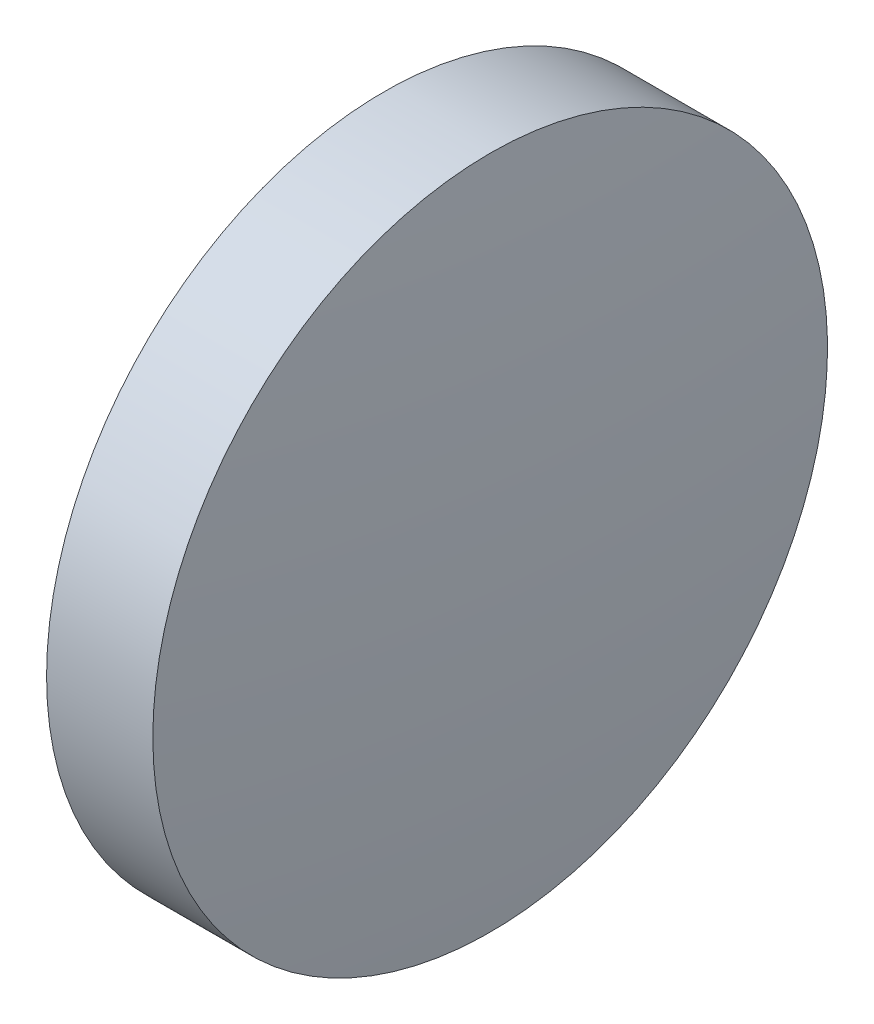
ISO-10303-21;
HEADER;
FILE_DESCRIPTION(('STEP AP214'),'2;1');
FILE_NAME('part.step','',(''),(''),'','','');
FILE_SCHEMA(('AUTOMOTIVE_DESIGN { 1 0 10303 214 1 1 1 1 }'));
ENDSEC;
DATA;
#1=APPLICATION_CONTEXT('core data for automotive mechanical design processes');
#2=APPLICATION_PROTOCOL_DEFINITION('international standard','automotive_design',2000,#1);
#3=PRODUCT_CONTEXT('',#1,'mechanical');
#4=PRODUCT('Part','Part','',(#3));
#5=PRODUCT_RELATED_PRODUCT_CATEGORY('part','',(#4));
#6=PRODUCT_DEFINITION_FORMATION('','',#4);
#7=PRODUCT_DEFINITION_CONTEXT('part definition',#1,'design');
#8=PRODUCT_DEFINITION('design','',#6,#7);
#9=PRODUCT_DEFINITION_SHAPE('','',#8);
#10=(LENGTH_UNIT() NAMED_UNIT(*) SI_UNIT(.MILLI.,.METRE.));
#11=(NAMED_UNIT(*) PLANE_ANGLE_UNIT() SI_UNIT($,.RADIAN.));
#12=(NAMED_UNIT(*) SI_UNIT($,.STERADIAN.) SOLID_ANGLE_UNIT());
#13=UNCERTAINTY_MEASURE_WITH_UNIT(LENGTH_MEASURE(1.E-05),#10,'distance_accuracy_value','');
#14=(GEOMETRIC_REPRESENTATION_CONTEXT(3) GLOBAL_UNCERTAINTY_ASSIGNED_CONTEXT((#13)) GLOBAL_UNIT_ASSIGNED_CONTEXT((#10,
#11,#12)) REPRESENTATION_CONTEXT('',''));
#15=CARTESIAN_POINT('',(0.,0.,0.));
#16=DIRECTION('',(0.,0.,1.));
#17=DIRECTION('',(1.,0.,0.));
#18=AXIS2_PLACEMENT_3D('',#15,#16,#17);
#19=CARTESIAN_POINT('',(-18.751599374773,26.0934219705649,0.));
#20=DIRECTION('',(-1.,0.,0.));
#21=DIRECTION('',(0.,1.,0.));
#22=AXIS2_PLACEMENT_3D('',#19,#20,#21);
#23=SPHERICAL_SURFACE('',#22,67.3541666666667);
#24=CARTESIAN_POINT('',(48.3025672918937,26.0934219705649,0.));
#25=DIRECTION('',(-1.,0.,0.));
#26=DIRECTION('',(0.,0.,1.));
#27=AXIS2_PLACEMENT_3D('',#24,#25,#26);
#28=CIRCLE('',#27,6.35);
#29=CARTESIAN_POINT('',(48.3025672918937,26.0934219705649,6.35));
#30=VERTEX_POINT('',#29);
#31=EDGE_CURVE('E10',#30,#30,#28,.T.);
#32=ORIENTED_EDGE('',*,*,#31,.F.);
#33=EDGE_LOOP('',(#32));
#34=FACE_BOUND('',#33,.T.);
#35=ADVANCED_FACE('F35',(#34),#23,.T.);
#36=CARTESIAN_POINT('',(44.0661492913954,26.0934219705649,0.));
#37=DIRECTION('',(-1.,0.,0.));
#38=DIRECTION('',(0.,0.,1.));
#39=AXIS2_PLACEMENT_3D('',#36,#37,#38);
#40=CYLINDRICAL_SURFACE('',#39,6.35);
#41=CARTESIAN_POINT('',(46.3025672918937,26.0934219705649,0.));
#42=DIRECTION('',(-1.,0.,0.));
#43=DIRECTION('',(0.,0.,1.));
#44=AXIS2_PLACEMENT_3D('',#41,#42,#43);
#45=CIRCLE('',#44,6.35);
#46=CARTESIAN_POINT('',(46.3025672918937,26.0934219705649,6.35));
#47=VERTEX_POINT('',#46);
#48=EDGE_CURVE('E41',#47,#47,#45,.T.);
#49=ORIENTED_EDGE('',*,*,#48,.F.);
#50=EDGE_LOOP('',(#49));
#51=FACE_BOUND('',#50,.T.);
#52=ORIENTED_EDGE('',*,*,#31,.T.);
#53=EDGE_LOOP('',(#52));
#54=FACE_BOUND('',#53,.T.);
#55=ADVANCED_FACE('F49',(#51,#54),#40,.T.);
#56=CARTESIAN_POINT('',(46.3025672918937,26.0934219705649,0.));
#57=DIRECTION('',(1.,0.,0.));
#58=DIRECTION('',(0.,0.,-1.));
#59=AXIS2_PLACEMENT_3D('',#56,#57,#58);
#60=PLANE('',#59);
#61=ORIENTED_EDGE('',*,*,#48,.T.);
#62=EDGE_LOOP('',(#61));
#63=FACE_BOUND('',#62,.T.);
#64=ADVANCED_FACE('F47',(#63),#60,.F.);
#65=CLOSED_SHELL('',(#35,#55,#64));
#66=MANIFOLD_SOLID_BREP('B2',#65);
#67=ADVANCED_BREP_SHAPE_REPRESENTATION('',(#18,#66),#14);
#68=SHAPE_DEFINITION_REPRESENTATION(#9,#67);
ENDSEC;
END-ISO-10303-21;
